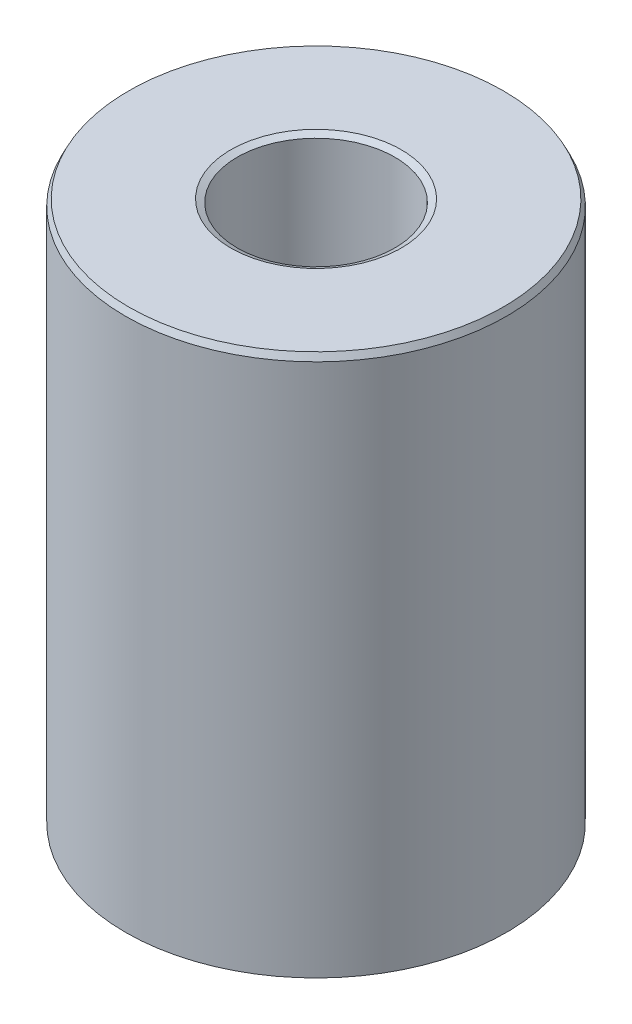
ISO-10303-21;
HEADER;
FILE_DESCRIPTION(('STEP AP214'),'2;1');
FILE_NAME('part.step','',(''),(''),'','','');
FILE_SCHEMA(('AUTOMOTIVE_DESIGN { 1 0 10303 214 1 1 1 1 }'));
ENDSEC;
DATA;
#1=APPLICATION_CONTEXT('core data for automotive mechanical design processes');
#2=APPLICATION_PROTOCOL_DEFINITION('international standard','automotive_design',2000,#1);
#3=PRODUCT_CONTEXT('',#1,'mechanical');
#4=PRODUCT('Part','Part','',(#3));
#5=PRODUCT_RELATED_PRODUCT_CATEGORY('part','',(#4));
#6=PRODUCT_DEFINITION_FORMATION('','',#4);
#7=PRODUCT_DEFINITION_CONTEXT('part definition',#1,'design');
#8=PRODUCT_DEFINITION('design','',#6,#7);
#9=PRODUCT_DEFINITION_SHAPE('','',#8);
#10=(LENGTH_UNIT() NAMED_UNIT(*) SI_UNIT(.MILLI.,.METRE.));
#11=(NAMED_UNIT(*) PLANE_ANGLE_UNIT() SI_UNIT($,.RADIAN.));
#12=(NAMED_UNIT(*) SI_UNIT($,.STERADIAN.) SOLID_ANGLE_UNIT());
#13=UNCERTAINTY_MEASURE_WITH_UNIT(LENGTH_MEASURE(1.E-05),#10,'distance_accuracy_value','');
#14=(GEOMETRIC_REPRESENTATION_CONTEXT(3) GLOBAL_UNCERTAINTY_ASSIGNED_CONTEXT((#13)) GLOBAL_UNIT_ASSIGNED_CONTEXT((#10,
#11,#12)) REPRESENTATION_CONTEXT('',''));
#15=CARTESIAN_POINT('',(0.,0.,0.));
#16=DIRECTION('',(0.,0.,1.));
#17=DIRECTION('',(1.,0.,0.));
#18=AXIS2_PLACEMENT_3D('',#15,#16,#17);
#19=CARTESIAN_POINT('',(0.,99.8299364744249,0.));
#20=DIRECTION('',(0.,-1.,0.));
#21=DIRECTION('',(0.,0.,-1.));
#22=AXIS2_PLACEMENT_3D('',#19,#20,#21);
#23=CYLINDRICAL_SURFACE('',#22,35.);
#24=CARTESIAN_POINT('',(0.,0.580741380037927,0.));
#25=DIRECTION('',(0.,1.,0.));
#26=DIRECTION('',(0.,0.,1.));
#27=AXIS2_PLACEMENT_3D('',#24,#25,#26);
#28=CIRCLE('',#27,35.);
#29=CARTESIAN_POINT('',(0.,0.580741380037927,35.));
#30=VERTEX_POINT('',#29);
#31=EDGE_CURVE('E10',#30,#30,#28,.T.);
#32=ORIENTED_EDGE('',*,*,#31,.T.);
#33=EDGE_LOOP('',(#32));
#34=FACE_BOUND('',#33,.T.);
#35=CARTESIAN_POINT('',(0.,98.641825331933,0.));
#36=DIRECTION('',(0.,1.,0.));
#37=DIRECTION('',(0.,0.,1.));
#38=AXIS2_PLACEMENT_3D('',#35,#36,#37);
#39=CIRCLE('',#38,35.);
#40=CARTESIAN_POINT('',(0.,98.641825331933,35.));
#41=VERTEX_POINT('',#40);
#42=EDGE_CURVE('E50',#41,#41,#39,.F.);
#43=ORIENTED_EDGE('',*,*,#42,.T.);
#44=EDGE_LOOP('',(#43));
#45=FACE_BOUND('',#44,.T.);
#46=ADVANCED_FACE('F39',(#34,#45),#23,.T.);
#47=CARTESIAN_POINT('',(0.,99.8299364744249,0.));
#48=DIRECTION('',(0.,1.,0.));
#49=DIRECTION('',(0.,0.,1.));
#50=AXIS2_PLACEMENT_3D('',#47,#48,#49);
#51=PLANE('',#50);
#52=CARTESIAN_POINT('',(0.,99.8299364744249,0.));
#53=DIRECTION('',(0.,1.,0.));
#54=DIRECTION('',(0.,0.,1.));
#55=AXIS2_PLACEMENT_3D('',#52,#53,#54);
#56=CIRCLE('',#55,15.665247028835);
#57=CARTESIAN_POINT('',(0.,99.8299364744249,15.6652470288349));
#58=VERTEX_POINT('',#57);
#59=EDGE_CURVE('E58',#58,#58,#56,.F.);
#60=ORIENTED_EDGE('',*,*,#59,.T.);
#61=EDGE_LOOP('',(#60));
#62=FACE_BOUND('',#61,.T.);
#63=CARTESIAN_POINT('',(0.,99.8299364744249,0.));
#64=DIRECTION('',(0.,1.,0.));
#65=DIRECTION('',(0.,0.,1.));
#66=AXIS2_PLACEMENT_3D('',#63,#64,#65);
#67=CIRCLE('',#66,34.4192586199621);
#68=CARTESIAN_POINT('',(0.,99.8299364744249,34.4192586199621));
#69=VERTEX_POINT('',#68);
#70=EDGE_CURVE('E61',#69,#69,#67,.T.);
#71=ORIENTED_EDGE('',*,*,#70,.T.);
#72=EDGE_LOOP('',(#71));
#73=FACE_BOUND('',#72,.T.);
#74=ADVANCED_FACE('F88',(#62,#73),#51,.T.);
#75=CARTESIAN_POINT('',(0.,0.,0.));
#76=DIRECTION('',(0.,1.,0.));
#77=DIRECTION('',(0.,0.,1.));
#78=AXIS2_PLACEMENT_3D('',#75,#76,#77);
#79=PLANE('',#78);
#80=CARTESIAN_POINT('',(0.,0.,0.));
#81=DIRECTION('',(0.,1.,0.));
#82=DIRECTION('',(0.,0.,1.));
#83=AXIS2_PLACEMENT_3D('',#80,#81,#82);
#84=CIRCLE('',#83,15.057877266381);
#85=CARTESIAN_POINT('',(0.,0.,15.057877266381));
#86=VERTEX_POINT('',#85);
#87=EDGE_CURVE('E51',#86,#86,#84,.T.);
#88=ORIENTED_EDGE('',*,*,#87,.T.);
#89=EDGE_LOOP('',(#88));
#90=FACE_BOUND('',#89,.T.);
#91=CARTESIAN_POINT('',(0.,0.,0.));
#92=DIRECTION('',(0.,1.,0.));
#93=DIRECTION('',(0.,0.,1.));
#94=AXIS2_PLACEMENT_3D('',#91,#92,#93);
#95=CIRCLE('',#94,33.8118888575081);
#96=CARTESIAN_POINT('',(0.,0.,33.8118888575081));
#97=VERTEX_POINT('',#96);
#98=EDGE_CURVE('E54',#97,#97,#95,.F.);
#99=ORIENTED_EDGE('',*,*,#98,.T.);
#100=EDGE_LOOP('',(#99));
#101=FACE_BOUND('',#100,.T.);
#102=ADVANCED_FACE('F83',(#90,#101),#79,.F.);
#103=CARTESIAN_POINT('',(0.,99.8299364744249,0.));
#104=DIRECTION('',(0.,-1.,0.));
#105=DIRECTION('',(0.,0.,-1.));
#106=AXIS2_PLACEMENT_3D('',#103,#104,#105);
#107=CYLINDRICAL_SURFACE('',#106,14.477135886343);
#108=CARTESIAN_POINT('',(0.,99.249195094387,0.));
#109=DIRECTION('',(0.,1.,0.));
#110=DIRECTION('',(0.,0.,1.));
#111=AXIS2_PLACEMENT_3D('',#108,#109,#110);
#112=CIRCLE('',#111,14.477135886343);
#113=CARTESIAN_POINT('',(0.,99.2491950943869,14.477135886343));
#114=VERTEX_POINT('',#113);
#115=EDGE_CURVE('E67',#114,#114,#112,.T.);
#116=ORIENTED_EDGE('',*,*,#115,.T.);
#117=EDGE_LOOP('',(#116));
#118=FACE_BOUND('',#117,.T.);
#119=CARTESIAN_POINT('',(0.,1.18811114249198,0.));
#120=DIRECTION('',(0.,1.,0.));
#121=DIRECTION('',(0.,0.,1.));
#122=AXIS2_PLACEMENT_3D('',#119,#120,#121);
#123=CIRCLE('',#122,14.477135886343);
#124=CARTESIAN_POINT('',(0.,1.18811114249198,14.477135886343));
#125=VERTEX_POINT('',#124);
#126=EDGE_CURVE('E69',#125,#125,#123,.F.);
#127=ORIENTED_EDGE('',*,*,#126,.T.);
#128=EDGE_LOOP('',(#127));
#129=FACE_BOUND('',#128,.T.);
#130=ADVANCED_FACE('F71',(#118,#129),#107,.F.);
#131=CARTESIAN_POINT('',(0.,99.249195094387,0.));
#132=DIRECTION('',(0.,1.,0.));
#133=DIRECTION('',(0.,0.,1.));
#134=AXIS2_PLACEMENT_3D('',#131,#132,#133);
#135=CONICAL_SURFACE('',#134,14.477135886343,1.11615378706522);
#136=CARTESIAN_POINT('',(0.,99.8299364744249,15.6652470288349));
#137=CARTESIAN_POINT('',(0.,99.8238870850495,15.6528708711006));
#138=CARTESIAN_POINT('',(0.,99.8178376956741,15.6404947133664));
#139=CARTESIAN_POINT('',(0.,99.8057389169233,15.6157423978978));
#140=CARTESIAN_POINT('',(0.,99.7996895275479,15.6033662401635));
#141=CARTESIAN_POINT('',(0.,99.7875907487971,15.5786139246949));
#142=CARTESIAN_POINT('',(0.,99.7815413594217,15.5662377669606));
#143=CARTESIAN_POINT('',(0.,99.7694425806709,15.541485451492));
#144=CARTESIAN_POINT('',(0.,99.7633931912955,15.5291092937577));
#145=CARTESIAN_POINT('',(0.,99.7512944125448,15.5043569782892));
#146=CARTESIAN_POINT('',(0.,99.7452450231694,15.4919808205549));
#147=CARTESIAN_POINT('',(0.,99.7331462444186,15.4672285050863));
#148=CARTESIAN_POINT('',(0.,99.7270968550432,15.454852347352));
#149=CARTESIAN_POINT('',(0.,99.7149980762924,15.4301000318834));
#150=CARTESIAN_POINT('',(0.,99.708948686917,15.4177238741491));
#151=CARTESIAN_POINT('',(0.,99.6968499081662,15.3929715586805));
#152=CARTESIAN_POINT('',(0.,99.6908005187908,15.3805954009462));
#153=CARTESIAN_POINT('',(0.,99.67870174004,15.3558430854777));
#154=CARTESIAN_POINT('',(0.,99.6726523506646,15.3434669277434));
#155=CARTESIAN_POINT('',(0.,99.6605535719138,15.3187146122748));
#156=CARTESIAN_POINT('',(0.,99.6545041825384,15.3063384545405));
#157=CARTESIAN_POINT('',(0.,99.6424054037876,15.2815861390719));
#158=CARTESIAN_POINT('',(0.,99.6363560144122,15.2692099813376));
#159=CARTESIAN_POINT('',(0.,99.6242572356615,15.244457665869));
#160=CARTESIAN_POINT('',(0.,99.6182078462861,15.2320815081348));
#161=CARTESIAN_POINT('',(0.,99.6061090675353,15.2073291926662));
#162=CARTESIAN_POINT('',(0.,99.6000596781599,15.1949530349319));
#163=CARTESIAN_POINT('',(0.,99.5879608994091,15.1702007194633));
#164=CARTESIAN_POINT('',(0.,99.5819115100337,15.157824561729));
#165=CARTESIAN_POINT('',(0.,99.5698127312829,15.1330722462604));
#166=CARTESIAN_POINT('',(0.,99.5637633419075,15.1206960885261));
#167=CARTESIAN_POINT('',(0.,99.5516645631567,15.0959437730576));
#168=CARTESIAN_POINT('',(0.,99.5456151737813,15.0835676153233));
#169=CARTESIAN_POINT('',(0.,99.5335163950305,15.0588152998547));
#170=CARTESIAN_POINT('',(0.,99.5274670056551,15.0464391421204));
#171=CARTESIAN_POINT('',(0.,99.5153682269043,15.0216868266518));
#172=CARTESIAN_POINT('',(0.,99.509318837529,15.0093106689175));
#173=CARTESIAN_POINT('',(0.,99.4972200587782,14.9845583534489));
#174=CARTESIAN_POINT('',(0.,99.4911706694028,14.9721821957146));
#175=CARTESIAN_POINT('',(0.,99.479071890652,14.9474298802461));
#176=CARTESIAN_POINT('',(0.,99.4730225012766,14.9350537225118));
#177=CARTESIAN_POINT('',(0.,99.4609237225258,14.9103014070432));
#178=CARTESIAN_POINT('',(0.,99.4548743331504,14.8979252493089));
#179=CARTESIAN_POINT('',(0.,99.4427755543996,14.8731729338403));
#180=CARTESIAN_POINT('',(0.,99.4367261650242,14.860796776106));
#181=CARTESIAN_POINT('',(0.,99.4246273862734,14.8360444606374));
#182=CARTESIAN_POINT('',(0.,99.418577996898,14.8236683029032));
#183=CARTESIAN_POINT('',(0.,99.4064792181472,14.7989159874346));
#184=CARTESIAN_POINT('',(0.,99.4004298287718,14.7865398297003));
#185=CARTESIAN_POINT('',(0.,99.3883310500211,14.7617875142317));
#186=CARTESIAN_POINT('',(0.,99.3822816606456,14.7494113564974));
#187=CARTESIAN_POINT('',(0.,99.3701828818949,14.7246590410288));
#188=CARTESIAN_POINT('',(0.,99.3641334925195,14.7122828832945));
#189=CARTESIAN_POINT('',(0.,99.3520347137687,14.6875305678259));
#190=CARTESIAN_POINT('',(0.,99.3459853243933,14.6751544100917));
#191=CARTESIAN_POINT('',(0.,99.3338865456425,14.6504020946231));
#192=CARTESIAN_POINT('',(0.,99.3278371562671,14.6380259368888));
#193=CARTESIAN_POINT('',(0.,99.3157383775163,14.6132736214202));
#194=CARTESIAN_POINT('',(0.,99.3096889881409,14.6008974636859));
#195=CARTESIAN_POINT('',(0.,99.2975902093901,14.5761451482173));
#196=CARTESIAN_POINT('',(0.,99.2915408200147,14.563768990483));
#197=CARTESIAN_POINT('',(0.,99.2794420412639,14.5390166750145));
#198=CARTESIAN_POINT('',(0.,99.2733926518885,14.5266405172802));
#199=CARTESIAN_POINT('',(0.,99.2612938731377,14.5018882018116));
#200=CARTESIAN_POINT('',(0.,99.2552444837624,14.4895120440773));
#201=CARTESIAN_POINT('',(0.,99.249195094387,14.477135886343));
#202=B_SPLINE_CURVE_WITH_KNOTS('',3,(#136,#137,#138,#139,#140,#141,#142,#143,#144,#145,#146,
#147,#148,#149,#150,#151,#152,#153,#154,#155,#156,#157,#158,#159,#160,#161,#162,#163,#164,#165,
#166,#167,#168,#169,#170,#171,#172,#173,#174,#175,#176,#177,#178,#179,#180,#181,#182,#183,#184,
#185,#186,#187,#188,#189,#190,#191,#192,#193,#194,#195,#196,#197,#198,#199,#200,#201),
.UNSPECIFIED.,.F.,.F.,(4,2,2,2,2,2,2,2,2,2,2,2,2,2,2,2,2,2,2,2,2,2,2,2,2,2,2,2,2,2,2,2,4),(0.,
0.0413264991102855,0.082652998220577,0.123979497330869,0.165305996441152,0.206632495551444,
0.247958994661736,0.289285493772026,0.330611992882311,0.371938491992603,0.413264991102894,
0.45459149021318,0.49591798932347,0.537244488433761,0.578570987544053,0.619897486654337,
0.661223985764628,0.70255048487492,0.743876983985205,0.785203483095495,0.826529982205787,
0.867856481316078,0.909182980426364,0.950509479536654,0.991835978646945,1.03316247775723,
1.07448897686752,1.11581547597781,1.1571419750881,1.19846847419839,1.23979497330868,
1.28112147241897,1.32244797152926),.UNSPECIFIED.);
#203=EDGE_CURVE('BSEAM77',#58,#114,#202,.T.);
#204=ORIENTED_EDGE('',*,*,#59,.F.);
#205=ORIENTED_EDGE('',*,*,#115,.F.);
#206=ORIENTED_EDGE('',*,*,#203,.T.);
#207=ORIENTED_EDGE('',*,*,#203,.F.);
#208=EDGE_LOOP('',(#204,#206,#205,#207));
#209=FACE_BOUND('',#208,.T.);
#210=ADVANCED_FACE('F77',(#209),#135,.F.);
#211=CARTESIAN_POINT('',(0.,0.,0.));
#212=DIRECTION('',(0.,-1.,0.));
#213=DIRECTION('',(0.,0.,-1.));
#214=AXIS2_PLACEMENT_3D('',#211,#212,#213);
#215=CONICAL_SURFACE('',#214,15.057877266381,0.454642539729676);
#216=ORIENTED_EDGE('',*,*,#126,.F.);
#217=EDGE_LOOP('',(#216));
#218=FACE_BOUND('',#217,.T.);
#219=ORIENTED_EDGE('',*,*,#87,.F.);
#220=EDGE_LOOP('',(#219));
#221=FACE_BOUND('',#220,.T.);
#222=ADVANCED_FACE('F73',(#218,#221),#215,.F.);
#223=CARTESIAN_POINT('',(0.,0.580741380037927,0.));
#224=DIRECTION('',(0.,1.,0.));
#225=DIRECTION('',(0.,0.,1.));
#226=AXIS2_PLACEMENT_3D('',#223,#224,#225);
#227=CONICAL_SURFACE('',#226,35.,1.11615378706522);
#228=CARTESIAN_POINT('',(0.,0.,33.8118888575081));
#229=CARTESIAN_POINT('',(0.,0.00604938937539564,33.8242650152423));
#230=CARTESIAN_POINT('',(0.,0.0120987787507906,33.8366411729766));
#231=CARTESIAN_POINT('',(0.,0.0241975575015805,33.8613934884452));
#232=CARTESIAN_POINT('',(0.,0.0302469468769755,33.8737696461795));
#233=CARTESIAN_POINT('',(0.,0.0423457256277652,33.8985219616481));
#234=CARTESIAN_POINT('',(0.,0.0483951150031599,33.9108981193824));
#235=CARTESIAN_POINT('',(0.,0.0604938937539504,33.935650434851));
#236=CARTESIAN_POINT('',(0.,0.0665432831293463,33.9480265925853));
#237=CARTESIAN_POINT('',(0.,0.0786420618801363,33.9727789080538));
#238=CARTESIAN_POINT('',(0.,0.0846914512555305,33.9851550657881));
#239=CARTESIAN_POINT('',(0.,0.0967902300063207,34.0099073812567));
#240=CARTESIAN_POINT('',(0.,0.102839619381717,34.022283538991));
#241=CARTESIAN_POINT('',(0.,0.114938398132507,34.0470358544596));
#242=CARTESIAN_POINT('',(0.,0.120987787507901,34.0594120121939));
#243=CARTESIAN_POINT('',(0.,0.133086566258691,34.0841643276625));
#244=CARTESIAN_POINT('',(0.,0.139135955634087,34.0965404853967));
#245=CARTESIAN_POINT('',(0.,0.151234734384877,34.1212928008653));
#246=CARTESIAN_POINT('',(0.,0.157284123760271,34.1336689585996));
#247=CARTESIAN_POINT('',(0.,0.169382902511062,34.1584212740682));
#248=CARTESIAN_POINT('',(0.,0.175432291886458,34.1707974318025));
#249=CARTESIAN_POINT('',(0.,0.187531070637248,34.1955497472711));
#250=CARTESIAN_POINT('',(0.,0.193580460012642,34.2079259050054));
#251=CARTESIAN_POINT('',(0.,0.205679238763432,34.232678220474));
#252=CARTESIAN_POINT('',(0.,0.211728628138828,34.2450543782082));
#253=CARTESIAN_POINT('',(0.,0.223827406889618,34.2698066936768));
#254=CARTESIAN_POINT('',(0.,0.229876796265012,34.2821828514111));
#255=CARTESIAN_POINT('',(0.,0.241975575015803,34.3069351668797));
#256=CARTESIAN_POINT('',(0.,0.248024964391198,34.319311324614));
#257=CARTESIAN_POINT('',(0.,0.260123743141989,34.3440636400826));
#258=CARTESIAN_POINT('',(0.,0.266173132517383,34.3564397978169));
#259=CARTESIAN_POINT('',(0.,0.278271911268173,34.3811921132855));
#260=CARTESIAN_POINT('',(0.,0.284321300643569,34.3935682710197));
#261=CARTESIAN_POINT('',(0.,0.296420079394359,34.4183205864883));
#262=CARTESIAN_POINT('',(0.,0.302469468769754,34.4306967442226));
#263=CARTESIAN_POINT('',(0.,0.314568247520544,34.4554490596912));
#264=CARTESIAN_POINT('',(0.,0.320617636895938,34.4678252174255));
#265=CARTESIAN_POINT('',(0.,0.332716415646729,34.4925775328941));
#266=CARTESIAN_POINT('',(0.,0.338765805022125,34.5049536906284));
#267=CARTESIAN_POINT('',(0.,0.350864583772915,34.5297060060969));
#268=CARTESIAN_POINT('',(0.,0.356913973148309,34.5420821638312));
#269=CARTESIAN_POINT('',(0.,0.369012751899099,34.5668344792998));
#270=CARTESIAN_POINT('',(0.,0.375062141274495,34.5792106370341));
#271=CARTESIAN_POINT('',(0.,0.387160920025285,34.6039629525027));
#272=CARTESIAN_POINT('',(0.,0.393210309400679,34.616339110237));
#273=CARTESIAN_POINT('',(0.,0.40530908815147,34.6410914257056));
#274=CARTESIAN_POINT('',(0.,0.411358477526866,34.6534675834399));
#275=CARTESIAN_POINT('',(0.,0.423457256277656,34.6782198989084));
#276=CARTESIAN_POINT('',(0.,0.42950664565305,34.6905960566427));
#277=CARTESIAN_POINT('',(0.,0.44160542440384,34.7153483721113));
#278=CARTESIAN_POINT('',(0.,0.447654813779236,34.7277245298456));
#279=CARTESIAN_POINT('',(0.,0.459753592530026,34.7524768453142));
#280=CARTESIAN_POINT('',(0.,0.46580298190542,34.7648530030485));
#281=CARTESIAN_POINT('',(0.,0.477901760656211,34.7896053185171));
#282=CARTESIAN_POINT('',(0.,0.483951150031607,34.8019814762513));
#283=CARTESIAN_POINT('',(0.,0.496049928782397,34.8267337917199));
#284=CARTESIAN_POINT('',(0.,0.502099318157791,34.8391099494542));
#285=CARTESIAN_POINT('',(0.,0.514198096908581,34.8638622649228));
#286=CARTESIAN_POINT('',(0.,0.520247486283977,34.8762384226571));
#287=CARTESIAN_POINT('',(0.,0.532346265034767,34.9009907381257));
#288=CARTESIAN_POINT('',(0.,0.538395654410161,34.91336689586));
#289=CARTESIAN_POINT('',(0.,0.550494433160951,34.9381192113286));
#290=CARTESIAN_POINT('',(0.,0.556543822536347,34.9504953690628));
#291=CARTESIAN_POINT('',(0.,0.568642601287138,34.9752476845314));
#292=CARTESIAN_POINT('',(0.,0.574691990662534,34.9876238422657));
#293=CARTESIAN_POINT('',(0.,0.580741380037927,35.));
#294=B_SPLINE_CURVE_WITH_KNOTS('',3,(#228,#229,#230,#231,#232,#233,#234,#235,#236,#237,#238,
#239,#240,#241,#242,#243,#244,#245,#246,#247,#248,#249,#250,#251,#252,#253,#254,#255,#256,#257,
#258,#259,#260,#261,#262,#263,#264,#265,#266,#267,#268,#269,#270,#271,#272,#273,#274,#275,#276,
#277,#278,#279,#280,#281,#282,#283,#284,#285,#286,#287,#288,#289,#290,#291,#292,#293),
.UNSPECIFIED.,.F.,.F.,(4,2,2,2,2,2,2,2,2,2,2,2,2,2,2,2,2,2,2,2,2,2,2,2,2,2,2,2,2,2,2,2,4),(0.,
0.0413264991102867,0.0826529982205797,0.123979497330873,0.165305996441159,0.206632495551452,
0.247958994661739,0.289285493772032,0.330611992882319,0.371938491992612,0.413264991102898,
0.454591490213191,0.495917989323478,0.537244488433771,0.578570987544058,0.619897486654351,
0.661223985764637,0.70255048487493,0.743876983985224,0.78520348309551,0.826529982205803,
0.86785648131609,0.909182980426383,0.95050947953667,0.991835978646962,1.03316247775725,
1.07448897686754,1.11581547597783,1.15714197508812,1.19846847419841,1.2397949733087,
1.28112147241899,1.32244797152928),.UNSPECIFIED.);
#295=EDGE_CURVE('BSEAM76',#97,#30,#294,.T.);
#296=ORIENTED_EDGE('',*,*,#98,.F.);
#297=ORIENTED_EDGE('',*,*,#31,.F.);
#298=ORIENTED_EDGE('',*,*,#295,.T.);
#299=ORIENTED_EDGE('',*,*,#295,.F.);
#300=EDGE_LOOP('',(#296,#298,#297,#299));
#301=FACE_BOUND('',#300,.T.);
#302=ADVANCED_FACE('F76',(#301),#227,.T.);
#303=CARTESIAN_POINT('',(0.,99.8299364744249,0.));
#304=DIRECTION('',(0.,-1.,0.));
#305=DIRECTION('',(0.,0.,-1.));
#306=AXIS2_PLACEMENT_3D('',#303,#304,#305);
#307=CONICAL_SURFACE('',#306,34.4192586199621,0.454642539729685);
#308=ORIENTED_EDGE('',*,*,#42,.F.);
#309=EDGE_LOOP('',(#308));
#310=FACE_BOUND('',#309,.T.);
#311=ORIENTED_EDGE('',*,*,#70,.F.);
#312=EDGE_LOOP('',(#311));
#313=FACE_BOUND('',#312,.T.);
#314=ADVANCED_FACE('F45',(#310,#313),#307,.T.);
#315=CLOSED_SHELL('',(#46,#74,#102,#130,#210,#222,#302,#314));
#316=MANIFOLD_SOLID_BREP('B2',#315);
#317=ADVANCED_BREP_SHAPE_REPRESENTATION('',(#18,#316),#14);
#318=SHAPE_DEFINITION_REPRESENTATION(#9,#317);
ENDSEC;
END-ISO-10303-21;
